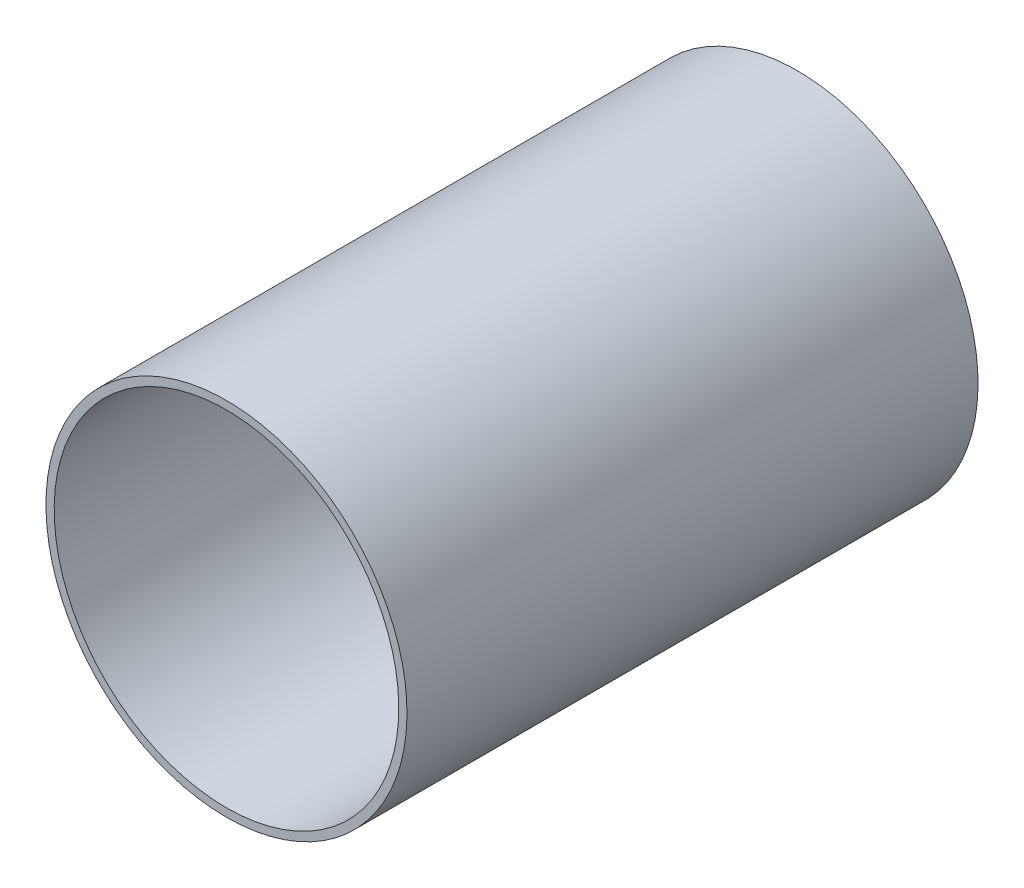
ISO-10303-21;
HEADER;
FILE_DESCRIPTION(('STEP AP214'),'2;1');
FILE_NAME('part.step','',(''),(''),'','','');
FILE_SCHEMA(('AUTOMOTIVE_DESIGN { 1 0 10303 214 1 1 1 1 }'));
ENDSEC;
DATA;
#1=APPLICATION_CONTEXT('core data for automotive mechanical design processes');
#2=APPLICATION_PROTOCOL_DEFINITION('international standard','automotive_design',2000,#1);
#3=PRODUCT_CONTEXT('',#1,'mechanical');
#4=PRODUCT('Part','Part','',(#3));
#5=PRODUCT_RELATED_PRODUCT_CATEGORY('part','',(#4));
#6=PRODUCT_DEFINITION_FORMATION('','',#4);
#7=PRODUCT_DEFINITION_CONTEXT('part definition',#1,'design');
#8=PRODUCT_DEFINITION('design','',#6,#7);
#9=PRODUCT_DEFINITION_SHAPE('','',#8);
#10=(LENGTH_UNIT() NAMED_UNIT(*) SI_UNIT(.MILLI.,.METRE.));
#11=(NAMED_UNIT(*) PLANE_ANGLE_UNIT() SI_UNIT($,.RADIAN.));
#12=(NAMED_UNIT(*) SI_UNIT($,.STERADIAN.) SOLID_ANGLE_UNIT());
#13=UNCERTAINTY_MEASURE_WITH_UNIT(LENGTH_MEASURE(1.E-05),#10,'distance_accuracy_value','');
#14=(GEOMETRIC_REPRESENTATION_CONTEXT(3) GLOBAL_UNCERTAINTY_ASSIGNED_CONTEXT((#13)) GLOBAL_UNIT_ASSIGNED_CONTEXT((#10,
#11,#12)) REPRESENTATION_CONTEXT('',''));
#15=CARTESIAN_POINT('',(0.,0.,0.));
#16=DIRECTION('',(0.,0.,1.));
#17=DIRECTION('',(1.,0.,0.));
#18=AXIS2_PLACEMENT_3D('',#15,#16,#17);
#19=CARTESIAN_POINT('',(158.952,-126.034,-0.045));
#20=DIRECTION('',(0.,0.,-1.));
#21=DIRECTION('',(0.,-1.,0.));
#22=AXIS2_PLACEMENT_3D('',#19,#20,#21);
#23=CYLINDRICAL_SURFACE('',#22,0.525);
#24=CARTESIAN_POINT('',(158.952,-126.034,-0.035));
#25=DIRECTION('',(0.,0.,-1.));
#26=DIRECTION('',(0.,-1.,0.));
#27=AXIS2_PLACEMENT_3D('',#24,#25,#26);
#28=CIRCLE('',#27,0.525);
#29=CARTESIAN_POINT('',(158.952,-126.559,-0.035));
#30=VERTEX_POINT('',#29);
#31=EDGE_CURVE('E64',#30,#30,#28,.T.);
#32=ORIENTED_EDGE('',*,*,#31,.T.);
#33=DIRECTION('',(0.,0.,1.));
#34=VECTOR('',#33,1.);
#35=CARTESIAN_POINT('',(158.952,-126.559,-0.045));
#36=LINE('',#35,#34);
#37=CARTESIAN_POINT('',(158.952,-126.559,1.705));
#38=VERTEX_POINT('',#37);
#39=EDGE_CURVE('E11',#30,#38,#36,.T.);
#40=ORIENTED_EDGE('',*,*,#39,.T.);
#41=CARTESIAN_POINT('',(158.952,-126.034,1.705));
#42=DIRECTION('',(0.,0.,-1.));
#43=DIRECTION('',(0.,-1.,0.));
#44=AXIS2_PLACEMENT_3D('',#41,#42,#43);
#45=CIRCLE('',#44,0.525);
#46=EDGE_CURVE('E25',#38,#38,#45,.T.);
#47=ORIENTED_EDGE('',*,*,#46,.F.);
#48=ORIENTED_EDGE('',*,*,#39,.F.);
#49=EDGE_LOOP('',(#32,#40,#47,#48));
#50=FACE_BOUND('',#49,.T.);
#51=ADVANCED_FACE('F17',(#50),#23,.F.);
#52=CARTESIAN_POINT('',(158.952,-126.584,1.705));
#53=DIRECTION('',(0.,0.,1.));
#54=DIRECTION('',(1.,0.,0.));
#55=AXIS2_PLACEMENT_3D('',#52,#53,#54);
#56=PLANE('',#55);
#57=ORIENTED_EDGE('',*,*,#46,.T.);
#58=EDGE_LOOP('',(#57));
#59=FACE_BOUND('',#58,.T.);
#60=CARTESIAN_POINT('',(158.952,-126.034,1.705));
#61=DIRECTION('',(0.,0.,1.));
#62=DIRECTION('',(0.,-1.,0.));
#63=AXIS2_PLACEMENT_3D('',#60,#61,#62);
#64=CIRCLE('',#63,0.55);
#65=CARTESIAN_POINT('',(158.952,-126.584,1.705));
#66=VERTEX_POINT('',#65);
#67=EDGE_CURVE('E56',#66,#66,#64,.T.);
#68=ORIENTED_EDGE('',*,*,#67,.T.);
#69=EDGE_LOOP('',(#68));
#70=FACE_BOUND('',#69,.T.);
#71=ADVANCED_FACE('F73',(#59,#70),#56,.T.);
#72=CARTESIAN_POINT('',(158.952,-126.584,-0.035));
#73=DIRECTION('',(0.,0.,1.));
#74=DIRECTION('',(1.,0.,0.));
#75=AXIS2_PLACEMENT_3D('',#72,#73,#74);
#76=PLANE('',#75);
#77=ORIENTED_EDGE('',*,*,#31,.F.);
#78=EDGE_LOOP('',(#77));
#79=FACE_BOUND('',#78,.T.);
#80=CARTESIAN_POINT('',(158.952,-126.034,-0.035));
#81=DIRECTION('',(0.,0.,1.));
#82=DIRECTION('',(0.,-1.,0.));
#83=AXIS2_PLACEMENT_3D('',#80,#81,#82);
#84=CIRCLE('',#83,0.55);
#85=CARTESIAN_POINT('',(158.952,-126.584,-0.035));
#86=VERTEX_POINT('',#85);
#87=EDGE_CURVE('E55',#86,#86,#84,.T.);
#88=ORIENTED_EDGE('',*,*,#87,.F.);
#89=EDGE_LOOP('',(#88));
#90=FACE_BOUND('',#89,.T.);
#91=ADVANCED_FACE('F82',(#79,#90),#76,.F.);
#92=CARTESIAN_POINT('',(158.952,-126.034,-0.035));
#93=DIRECTION('',(0.,0.,-1.));
#94=DIRECTION('',(0.,-1.,0.));
#95=AXIS2_PLACEMENT_3D('',#92,#93,#94);
#96=CYLINDRICAL_SURFACE('',#95,0.55);
#97=ORIENTED_EDGE('',*,*,#87,.T.);
#98=DIRECTION('',(0.,0.,1.));
#99=VECTOR('',#98,1.);
#100=CARTESIAN_POINT('',(158.952,-126.584,-0.035));
#101=LINE('',#100,#99);
#102=EDGE_CURVE('E52',#86,#66,#101,.T.);
#103=ORIENTED_EDGE('',*,*,#102,.T.);
#104=ORIENTED_EDGE('',*,*,#67,.F.);
#105=ORIENTED_EDGE('',*,*,#102,.F.);
#106=EDGE_LOOP('',(#97,#103,#104,#105));
#107=FACE_BOUND('',#106,.T.);
#108=ADVANCED_FACE('F53',(#107),#96,.T.);
#109=CLOSED_SHELL('',(#51,#71,#91,#108));
#110=MANIFOLD_SOLID_BREP('B1',#109);
#111=ADVANCED_BREP_SHAPE_REPRESENTATION('',(#18,#110),#14);
#112=SHAPE_DEFINITION_REPRESENTATION(#9,#111);
ENDSEC;
END-ISO-10303-21;
